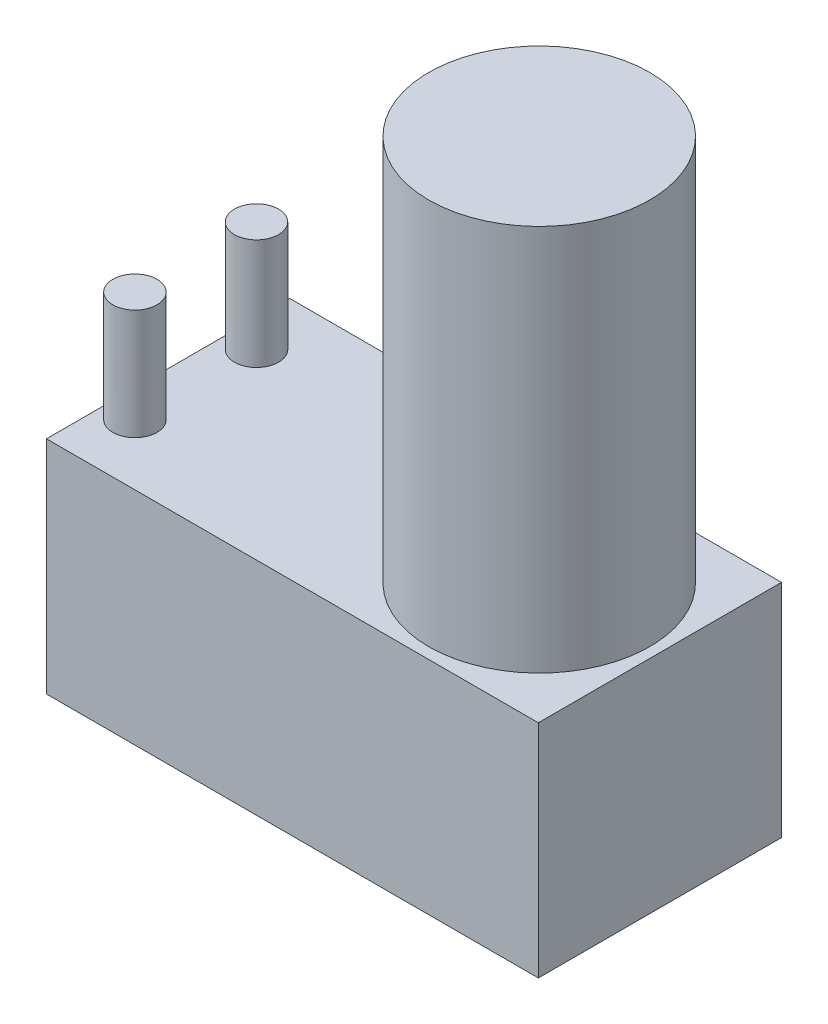
ISO-10303-21;
HEADER;
FILE_DESCRIPTION(('STEP AP214'),'2;1');
FILE_NAME('part.step','',(''),(''),'','','');
FILE_SCHEMA(('AUTOMOTIVE_DESIGN { 1 0 10303 214 1 1 1 1 }'));
ENDSEC;
DATA;
#1=APPLICATION_CONTEXT('core data for automotive mechanical design processes');
#2=APPLICATION_PROTOCOL_DEFINITION('international standard','automotive_design',2000,#1);
#3=PRODUCT_CONTEXT('',#1,'mechanical');
#4=PRODUCT('Part','Part','',(#3));
#5=PRODUCT_RELATED_PRODUCT_CATEGORY('part','',(#4));
#6=PRODUCT_DEFINITION_FORMATION('','',#4);
#7=PRODUCT_DEFINITION_CONTEXT('part definition',#1,'design');
#8=PRODUCT_DEFINITION('design','',#6,#7);
#9=PRODUCT_DEFINITION_SHAPE('','',#8);
#10=(LENGTH_UNIT() NAMED_UNIT(*) SI_UNIT(.MILLI.,.METRE.));
#11=(NAMED_UNIT(*) PLANE_ANGLE_UNIT() SI_UNIT($,.RADIAN.));
#12=(NAMED_UNIT(*) SI_UNIT($,.STERADIAN.) SOLID_ANGLE_UNIT());
#13=UNCERTAINTY_MEASURE_WITH_UNIT(LENGTH_MEASURE(1.E-05),#10,'distance_accuracy_value','');
#14=(GEOMETRIC_REPRESENTATION_CONTEXT(3) GLOBAL_UNCERTAINTY_ASSIGNED_CONTEXT((#13)) GLOBAL_UNIT_ASSIGNED_CONTEXT((#10,
#11,#12)) REPRESENTATION_CONTEXT('',''));
#15=CARTESIAN_POINT('',(0.,0.,0.));
#16=DIRECTION('',(0.,0.,1.));
#17=DIRECTION('',(1.,0.,0.));
#18=AXIS2_PLACEMENT_3D('',#15,#16,#17);
#19=CARTESIAN_POINT('',(0.,40.,0.));
#20=DIRECTION('',(0.,-1.,0.));
#21=DIRECTION('',(0.,0.,-1.));
#22=AXIS2_PLACEMENT_3D('',#19,#20,#21);
#23=PLANE('',#22);
#24=CARTESIAN_POINT('',(-39.5,40.,-11.));
#25=DIRECTION('',(0.,1.,0.));
#26=DIRECTION('',(0.,0.,1.));
#27=AXIS2_PLACEMENT_3D('',#24,#25,#26);
#28=CIRCLE('',#27,4.);
#29=CARTESIAN_POINT('',(-39.5,40.,-7.));
#30=VERTEX_POINT('',#29);
#31=EDGE_CURVE('E151',#30,#30,#28,.F.);
#32=ORIENTED_EDGE('',*,*,#31,.T.);
#33=EDGE_LOOP('',(#32));
#34=FACE_BOUND('',#33,.T.);
#35=CARTESIAN_POINT('',(22.6624855160635,40.,0.));
#36=DIRECTION('',(0.,1.,0.));
#37=DIRECTION('',(0.,0.,1.));
#38=AXIS2_PLACEMENT_3D('',#35,#36,#37);
#39=CIRCLE('',#38,20.);
#40=CARTESIAN_POINT('',(22.6624855160635,40.,20.));
#41=VERTEX_POINT('',#40);
#42=EDGE_CURVE('E55',#41,#41,#39,.T.);
#43=ORIENTED_EDGE('',*,*,#42,.F.);
#44=EDGE_LOOP('',(#43));
#45=FACE_BOUND('',#44,.T.);
#46=DIRECTION('',(0.,0.,-1.));
#47=VECTOR('',#46,1.);
#48=CARTESIAN_POINT('',(44.5,40.,22.));
#49=LINE('',#48,#47);
#50=CARTESIAN_POINT('',(44.5,40.,22.));
#51=VERTEX_POINT('',#50);
#52=CARTESIAN_POINT('',(44.5,40.,-22.));
#53=VERTEX_POINT('',#52);
#54=EDGE_CURVE('E99',#51,#53,#49,.T.);
#55=ORIENTED_EDGE('',*,*,#54,.T.);
#56=DIRECTION('',(-1.,0.,0.));
#57=VECTOR('',#56,1.);
#58=CARTESIAN_POINT('',(-44.5,40.,-22.));
#59=LINE('',#58,#57);
#60=CARTESIAN_POINT('',(-44.5,40.,-22.));
#61=VERTEX_POINT('',#60);
#62=EDGE_CURVE('E94',#53,#61,#59,.T.);
#63=ORIENTED_EDGE('',*,*,#62,.T.);
#64=DIRECTION('',(0.,0.,1.));
#65=VECTOR('',#64,1.);
#66=CARTESIAN_POINT('',(-44.5,40.,22.));
#67=LINE('',#66,#65);
#68=CARTESIAN_POINT('',(-44.5,40.,22.));
#69=VERTEX_POINT('',#68);
#70=EDGE_CURVE('E97',#61,#69,#67,.T.);
#71=ORIENTED_EDGE('',*,*,#70,.T.);
#72=DIRECTION('',(1.,0.,0.));
#73=VECTOR('',#72,1.);
#74=CARTESIAN_POINT('',(-44.5,40.,22.));
#75=LINE('',#74,#73);
#76=EDGE_CURVE('E63',#69,#51,#75,.T.);
#77=ORIENTED_EDGE('',*,*,#76,.T.);
#78=EDGE_LOOP('',(#55,#63,#71,#77));
#79=FACE_BOUND('',#78,.T.);
#80=CARTESIAN_POINT('',(-39.5,40.,11.));
#81=DIRECTION('',(0.,-1.,0.));
#82=DIRECTION('',(0.,0.,-1.));
#83=AXIS2_PLACEMENT_3D('',#80,#81,#82);
#84=CIRCLE('',#83,4.);
#85=CARTESIAN_POINT('',(-39.5,40.,7.));
#86=VERTEX_POINT('',#85);
#87=EDGE_CURVE('E11',#86,#86,#84,.F.);
#88=ORIENTED_EDGE('',*,*,#87,.F.);
#89=EDGE_LOOP('',(#88));
#90=FACE_BOUND('',#89,.T.);
#91=ADVANCED_FACE('F45',(#34,#45,#79,#90),#23,.F.);
#92=CARTESIAN_POINT('',(44.5,40.,22.));
#93=DIRECTION('',(-1.,0.,0.));
#94=DIRECTION('',(0.,0.,1.));
#95=AXIS2_PLACEMENT_3D('',#92,#93,#94);
#96=PLANE('',#95);
#97=DIRECTION('',(0.,0.,-1.));
#98=VECTOR('',#97,1.);
#99=CARTESIAN_POINT('',(44.5,0.,22.));
#100=LINE('',#99,#98);
#101=CARTESIAN_POINT('',(44.5,0.,22.));
#102=VERTEX_POINT('',#101);
#103=CARTESIAN_POINT('',(44.5,0.,-22.));
#104=VERTEX_POINT('',#103);
#105=EDGE_CURVE('E118',#102,#104,#100,.T.);
#106=ORIENTED_EDGE('',*,*,#105,.T.);
#107=DIRECTION('',(0.,-1.,0.));
#108=VECTOR('',#107,1.);
#109=CARTESIAN_POINT('',(44.5,40.,-22.));
#110=LINE('',#109,#108);
#111=EDGE_CURVE('E107',#53,#104,#110,.T.);
#112=ORIENTED_EDGE('',*,*,#111,.F.);
#113=ORIENTED_EDGE('',*,*,#54,.F.);
#114=DIRECTION('',(0.,-1.,0.));
#115=VECTOR('',#114,1.);
#116=CARTESIAN_POINT('',(44.5,40.,22.));
#117=LINE('',#116,#115);
#118=EDGE_CURVE('E114',#51,#102,#117,.T.);
#119=ORIENTED_EDGE('',*,*,#118,.T.);
#120=EDGE_LOOP('',(#106,#112,#113,#119));
#121=FACE_BOUND('',#120,.T.);
#122=ADVANCED_FACE('F47',(#121),#96,.F.);
#123=CARTESIAN_POINT('',(-44.5,40.,-22.));
#124=DIRECTION('',(0.,0.,1.));
#125=DIRECTION('',(1.,0.,0.));
#126=AXIS2_PLACEMENT_3D('',#123,#124,#125);
#127=PLANE('',#126);
#128=DIRECTION('',(-1.,0.,0.));
#129=VECTOR('',#128,1.);
#130=CARTESIAN_POINT('',(-44.5,0.,-22.));
#131=LINE('',#130,#129);
#132=CARTESIAN_POINT('',(-44.5,0.,-22.));
#133=VERTEX_POINT('',#132);
#134=EDGE_CURVE('E105',#104,#133,#131,.T.);
#135=ORIENTED_EDGE('',*,*,#134,.T.);
#136=DIRECTION('',(0.,-1.,0.));
#137=VECTOR('',#136,1.);
#138=CARTESIAN_POINT('',(-44.5,40.,-22.));
#139=LINE('',#138,#137);
#140=EDGE_CURVE('E103',#61,#133,#139,.T.);
#141=ORIENTED_EDGE('',*,*,#140,.F.);
#142=ORIENTED_EDGE('',*,*,#62,.F.);
#143=ORIENTED_EDGE('',*,*,#111,.T.);
#144=EDGE_LOOP('',(#135,#141,#142,#143));
#145=FACE_BOUND('',#144,.T.);
#146=ADVANCED_FACE('F104',(#145),#127,.F.);
#147=CARTESIAN_POINT('',(-44.5,40.,22.));
#148=DIRECTION('',(1.,0.,0.));
#149=DIRECTION('',(0.,0.,-1.));
#150=AXIS2_PLACEMENT_3D('',#147,#148,#149);
#151=PLANE('',#150);
#152=DIRECTION('',(0.,0.,1.));
#153=VECTOR('',#152,1.);
#154=CARTESIAN_POINT('',(-44.5,0.,22.));
#155=LINE('',#154,#153);
#156=CARTESIAN_POINT('',(-44.5,0.,22.));
#157=VERTEX_POINT('',#156);
#158=EDGE_CURVE('E80',#133,#157,#155,.T.);
#159=ORIENTED_EDGE('',*,*,#158,.T.);
#160=DIRECTION('',(0.,-1.,0.));
#161=VECTOR('',#160,1.);
#162=CARTESIAN_POINT('',(-44.5,40.,22.));
#163=LINE('',#162,#161);
#164=EDGE_CURVE('E108',#69,#157,#163,.T.);
#165=ORIENTED_EDGE('',*,*,#164,.F.);
#166=ORIENTED_EDGE('',*,*,#70,.F.);
#167=ORIENTED_EDGE('',*,*,#140,.T.);
#168=EDGE_LOOP('',(#159,#165,#166,#167));
#169=FACE_BOUND('',#168,.T.);
#170=ADVANCED_FACE('F110',(#169),#151,.F.);
#171=CARTESIAN_POINT('',(-44.5,40.,22.));
#172=DIRECTION('',(0.,0.,-1.));
#173=DIRECTION('',(-1.,0.,0.));
#174=AXIS2_PLACEMENT_3D('',#171,#172,#173);
#175=PLANE('',#174);
#176=DIRECTION('',(1.,0.,0.));
#177=VECTOR('',#176,1.);
#178=CARTESIAN_POINT('',(-44.5,0.,22.));
#179=LINE('',#178,#177);
#180=EDGE_CURVE('E86',#157,#102,#179,.T.);
#181=ORIENTED_EDGE('',*,*,#180,.T.);
#182=ORIENTED_EDGE('',*,*,#118,.F.);
#183=ORIENTED_EDGE('',*,*,#76,.F.);
#184=ORIENTED_EDGE('',*,*,#164,.T.);
#185=EDGE_LOOP('',(#181,#182,#183,#184));
#186=FACE_BOUND('',#185,.T.);
#187=ADVANCED_FACE('F185',(#186),#175,.F.);
#188=CARTESIAN_POINT('',(0.,0.,0.));
#189=DIRECTION('',(0.,-1.,0.));
#190=DIRECTION('',(0.,0.,-1.));
#191=AXIS2_PLACEMENT_3D('',#188,#189,#190);
#192=PLANE('',#191);
#193=ORIENTED_EDGE('',*,*,#105,.F.);
#194=ORIENTED_EDGE('',*,*,#180,.F.);
#195=ORIENTED_EDGE('',*,*,#158,.F.);
#196=ORIENTED_EDGE('',*,*,#134,.F.);
#197=EDGE_LOOP('',(#193,#194,#195,#196));
#198=FACE_BOUND('',#197,.T.);
#199=ADVANCED_FACE('F182',(#198),#192,.T.);
#200=CARTESIAN_POINT('',(22.6624855160635,110.,0.));
#201=DIRECTION('',(0.,-1.,0.));
#202=DIRECTION('',(0.,0.,-1.));
#203=AXIS2_PLACEMENT_3D('',#200,#201,#202);
#204=CYLINDRICAL_SURFACE('',#203,20.);
#205=CARTESIAN_POINT('',(22.6624855160635,110.,0.));
#206=DIRECTION('',(0.,1.,0.));
#207=DIRECTION('',(0.,0.,1.));
#208=AXIS2_PLACEMENT_3D('',#205,#206,#207);
#209=CIRCLE('',#208,20.);
#210=CARTESIAN_POINT('',(22.6624855160635,110.,20.));
#211=VERTEX_POINT('',#210);
#212=EDGE_CURVE('E122',#211,#211,#209,.T.);
#213=ORIENTED_EDGE('',*,*,#212,.F.);
#214=EDGE_LOOP('',(#213));
#215=FACE_BOUND('',#214,.T.);
#216=ORIENTED_EDGE('',*,*,#42,.T.);
#217=EDGE_LOOP('',(#216));
#218=FACE_BOUND('',#217,.T.);
#219=ADVANCED_FACE('F172',(#215,#218),#204,.T.);
#220=CARTESIAN_POINT('',(22.6624855160635,110.,0.));
#221=DIRECTION('',(0.,1.,0.));
#222=DIRECTION('',(0.,0.,1.));
#223=AXIS2_PLACEMENT_3D('',#220,#221,#222);
#224=PLANE('',#223);
#225=ORIENTED_EDGE('',*,*,#212,.T.);
#226=EDGE_LOOP('',(#225));
#227=FACE_BOUND('',#226,.T.);
#228=ADVANCED_FACE('F161',(#227),#224,.T.);
#229=CARTESIAN_POINT('',(-39.5,60.,-11.));
#230=DIRECTION('',(0.,-1.,0.));
#231=DIRECTION('',(0.,0.,-1.));
#232=AXIS2_PLACEMENT_3D('',#229,#230,#231);
#233=CYLINDRICAL_SURFACE('',#232,4.);
#234=CARTESIAN_POINT('',(-39.5,60.,-11.));
#235=DIRECTION('',(0.,1.,0.));
#236=DIRECTION('',(0.,0.,1.));
#237=AXIS2_PLACEMENT_3D('',#234,#235,#236);
#238=CIRCLE('',#237,4.);
#239=CARTESIAN_POINT('',(-39.5,60.,-7.));
#240=VERTEX_POINT('',#239);
#241=EDGE_CURVE('E147',#240,#240,#238,.F.);
#242=ORIENTED_EDGE('',*,*,#241,.T.);
#243=EDGE_LOOP('',(#242));
#244=FACE_BOUND('',#243,.T.);
#245=ORIENTED_EDGE('',*,*,#31,.F.);
#246=EDGE_LOOP('',(#245));
#247=FACE_BOUND('',#246,.T.);
#248=ADVANCED_FACE('F158',(#244,#247),#233,.T.);
#249=CARTESIAN_POINT('',(0.,60.,0.));
#250=DIRECTION('',(0.,1.,0.));
#251=DIRECTION('',(0.,0.,1.));
#252=AXIS2_PLACEMENT_3D('',#249,#250,#251);
#253=PLANE('',#252);
#254=ORIENTED_EDGE('',*,*,#241,.F.);
#255=EDGE_LOOP('',(#254));
#256=FACE_BOUND('',#255,.T.);
#257=ADVANCED_FACE('F160',(#256),#253,.T.);
#258=CARTESIAN_POINT('',(-39.5,60.,11.));
#259=DIRECTION('',(0.,-1.,0.));
#260=DIRECTION('',(0.,0.,-1.));
#261=AXIS2_PLACEMENT_3D('',#258,#259,#260);
#262=CYLINDRICAL_SURFACE('',#261,4.);
#263=CARTESIAN_POINT('',(-39.5,60.,11.));
#264=DIRECTION('',(0.,1.,0.));
#265=DIRECTION('',(0.,0.,1.));
#266=AXIS2_PLACEMENT_3D('',#263,#264,#265);
#267=CIRCLE('',#266,4.);
#268=CARTESIAN_POINT('',(-39.5,60.,15.));
#269=VERTEX_POINT('',#268);
#270=EDGE_CURVE('E144',#269,#269,#267,.T.);
#271=ORIENTED_EDGE('',*,*,#270,.F.);
#272=EDGE_LOOP('',(#271));
#273=FACE_BOUND('',#272,.T.);
#274=ORIENTED_EDGE('',*,*,#87,.T.);
#275=EDGE_LOOP('',(#274));
#276=FACE_BOUND('',#275,.T.);
#277=ADVANCED_FACE('F168',(#273,#276),#262,.T.);
#278=CARTESIAN_POINT('',(0.,60.,0.));
#279=DIRECTION('',(0.,1.,0.));
#280=DIRECTION('',(0.,0.,1.));
#281=AXIS2_PLACEMENT_3D('',#278,#279,#280);
#282=PLANE('',#281);
#283=ORIENTED_EDGE('',*,*,#270,.T.);
#284=EDGE_LOOP('',(#283));
#285=FACE_BOUND('',#284,.T.);
#286=ADVANCED_FACE('F246',(#285),#282,.T.);
#287=CLOSED_SHELL('',(#91,#122,#146,#170,#187,#199,#219,#228,#248,#257,#277,#286));
#288=MANIFOLD_SOLID_BREP('B2',#287);
#289=ADVANCED_BREP_SHAPE_REPRESENTATION('',(#18,#288),#14);
#290=SHAPE_DEFINITION_REPRESENTATION(#9,#289);
ENDSEC;
END-ISO-10303-21;
